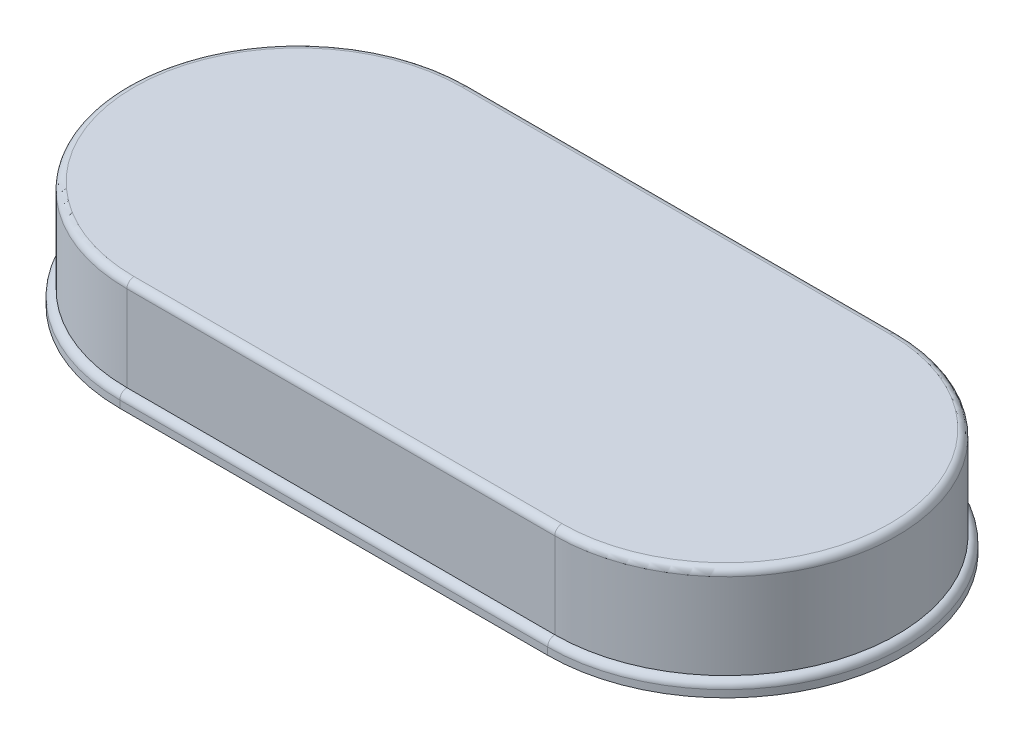
ISO-10303-21;
HEADER;
FILE_DESCRIPTION(('STEP AP214'),'2;1');
FILE_NAME('part.step','',(''),(''),'','','');
FILE_SCHEMA(('AUTOMOTIVE_DESIGN { 1 0 10303 214 1 1 1 1 }'));
ENDSEC;
DATA;
#1=APPLICATION_CONTEXT('core data for automotive mechanical design processes');
#2=APPLICATION_PROTOCOL_DEFINITION('international standard','automotive_design',2000,#1);
#3=PRODUCT_CONTEXT('',#1,'mechanical');
#4=PRODUCT('Part','Part','',(#3));
#5=PRODUCT_RELATED_PRODUCT_CATEGORY('part','',(#4));
#6=PRODUCT_DEFINITION_FORMATION('','',#4);
#7=PRODUCT_DEFINITION_CONTEXT('part definition',#1,'design');
#8=PRODUCT_DEFINITION('design','',#6,#7);
#9=PRODUCT_DEFINITION_SHAPE('','',#8);
#10=(LENGTH_UNIT() NAMED_UNIT(*) SI_UNIT(.MILLI.,.METRE.));
#11=(NAMED_UNIT(*) PLANE_ANGLE_UNIT() SI_UNIT($,.RADIAN.));
#12=(NAMED_UNIT(*) SI_UNIT($,.STERADIAN.) SOLID_ANGLE_UNIT());
#13=UNCERTAINTY_MEASURE_WITH_UNIT(LENGTH_MEASURE(1.E-05),#10,'distance_accuracy_value','');
#14=(GEOMETRIC_REPRESENTATION_CONTEXT(3) GLOBAL_UNCERTAINTY_ASSIGNED_CONTEXT((#13)) GLOBAL_UNIT_ASSIGNED_CONTEXT((#10,
#11,#12)) REPRESENTATION_CONTEXT('',''));
#15=CARTESIAN_POINT('',(0.,0.,0.));
#16=DIRECTION('',(0.,0.,1.));
#17=DIRECTION('',(1.,0.,0.));
#18=AXIS2_PLACEMENT_3D('',#15,#16,#17);
#19=CARTESIAN_POINT('',(8.77463258317007,0.2,-12.3727258149233));
#20=DIRECTION('',(0.,-1.,0.));
#21=DIRECTION('',(0.,0.,-1.));
#22=AXIS2_PLACEMENT_3D('',#19,#20,#21);
#23=CYLINDRICAL_SURFACE('',#22,2.5);
#24=DIRECTION('',(0.,-1.,0.));
#25=VECTOR('',#24,1.);
#26=CARTESIAN_POINT('',(8.77463258317007,0.2,-9.87272581492333));
#27=LINE('',#26,#25);
#28=CARTESIAN_POINT('',(8.77463258317007,0.1,-9.87272581492333));
#29=VERTEX_POINT('',#28);
#30=CARTESIAN_POINT('',(8.77463258317007,0.,-9.87272581492333));
#31=VERTEX_POINT('',#30);
#32=EDGE_CURVE('E131',#29,#31,#27,.T.);
#33=ORIENTED_EDGE('',*,*,#32,.F.);
#34=CARTESIAN_POINT('',(8.77463258317007,0.1,-12.3727258149233));
#35=DIRECTION('',(0.,1.,0.));
#36=DIRECTION('',(0.,0.,1.));
#37=AXIS2_PLACEMENT_3D('',#34,#35,#36);
#38=CIRCLE('',#37,2.5);
#39=CARTESIAN_POINT('',(8.77463258317007,0.1,-14.8727258149233));
#40=VERTEX_POINT('',#39);
#41=EDGE_CURVE('E156',#29,#40,#38,.F.);
#42=ORIENTED_EDGE('',*,*,#41,.T.);
#43=DIRECTION('',(0.,-1.,0.));
#44=VECTOR('',#43,1.);
#45=CARTESIAN_POINT('',(8.77463258317007,0.2,-14.8727258149233));
#46=LINE('',#45,#44);
#47=CARTESIAN_POINT('',(8.77463258317007,0.,-14.8727258149233));
#48=VERTEX_POINT('',#47);
#49=EDGE_CURVE('E216',#40,#48,#46,.T.);
#50=ORIENTED_EDGE('',*,*,#49,.T.);
#51=CARTESIAN_POINT('',(8.77463258317007,0.,-12.3727258149233));
#52=DIRECTION('',(0.,1.,0.));
#53=DIRECTION('',(0.,0.,1.));
#54=AXIS2_PLACEMENT_3D('',#51,#52,#53);
#55=CIRCLE('',#54,2.5);
#56=EDGE_CURVE('E164',#48,#31,#55,.T.);
#57=ORIENTED_EDGE('',*,*,#56,.T.);
#58=EDGE_LOOP('',(#33,#42,#50,#57));
#59=FACE_BOUND('',#58,.T.);
#60=ADVANCED_FACE('F32',(#59),#23,.T.);
#61=CARTESIAN_POINT('',(8.77463258317007,0.2,-9.87272581492333));
#62=DIRECTION('',(0.,0.,-1.));
#63=DIRECTION('',(-1.,0.,0.));
#64=AXIS2_PLACEMENT_3D('',#61,#62,#63);
#65=PLANE('',#64);
#66=DIRECTION('',(0.,-1.,0.));
#67=VECTOR('',#66,1.);
#68=CARTESIAN_POINT('',(14.7746325831701,0.2,-9.87272581492333));
#69=LINE('',#68,#67);
#70=CARTESIAN_POINT('',(14.7746325831701,0.1,-9.87272581492333));
#71=VERTEX_POINT('',#70);
#72=CARTESIAN_POINT('',(14.7746325831701,0.,-9.87272581492333));
#73=VERTEX_POINT('',#72);
#74=EDGE_CURVE('E220',#71,#73,#69,.T.);
#75=ORIENTED_EDGE('',*,*,#74,.F.);
#76=DIRECTION('',(1.,0.,0.));
#77=VECTOR('',#76,1.);
#78=CARTESIAN_POINT('',(8.77463258317007,0.1,-9.87272581492333));
#79=LINE('',#78,#77);
#80=EDGE_CURVE('E154',#71,#29,#79,.F.);
#81=ORIENTED_EDGE('',*,*,#80,.T.);
#82=ORIENTED_EDGE('',*,*,#32,.T.);
#83=DIRECTION('',(1.,0.,0.));
#84=VECTOR('',#83,1.);
#85=CARTESIAN_POINT('',(8.77463258317007,0.,-9.87272581492333));
#86=LINE('',#85,#84);
#87=EDGE_CURVE('E207',#31,#73,#86,.T.);
#88=ORIENTED_EDGE('',*,*,#87,.T.);
#89=EDGE_LOOP('',(#75,#81,#82,#88));
#90=FACE_BOUND('',#89,.T.);
#91=ADVANCED_FACE('F248',(#90),#65,.F.);
#92=CARTESIAN_POINT('',(14.7746325831701,0.2,-12.3727258149233));
#93=DIRECTION('',(0.,-1.,0.));
#94=DIRECTION('',(0.,0.,-1.));
#95=AXIS2_PLACEMENT_3D('',#92,#93,#94);
#96=CYLINDRICAL_SURFACE('',#95,2.5);
#97=DIRECTION('',(0.,-1.,0.));
#98=VECTOR('',#97,1.);
#99=CARTESIAN_POINT('',(14.7746325831701,0.2,-14.8727258149233));
#100=LINE('',#99,#98);
#101=CARTESIAN_POINT('',(14.7746325831701,0.1,-14.8727258149233));
#102=VERTEX_POINT('',#101);
#103=CARTESIAN_POINT('',(14.7746325831701,0.,-14.8727258149233));
#104=VERTEX_POINT('',#103);
#105=EDGE_CURVE('E218',#102,#104,#100,.T.);
#106=ORIENTED_EDGE('',*,*,#105,.F.);
#107=CARTESIAN_POINT('',(14.7746325831701,0.1,-12.3727258149233));
#108=DIRECTION('',(0.,1.,0.));
#109=DIRECTION('',(0.,0.,1.));
#110=AXIS2_PLACEMENT_3D('',#107,#108,#109);
#111=CIRCLE('',#110,2.5);
#112=EDGE_CURVE('E148',#102,#71,#111,.F.);
#113=ORIENTED_EDGE('',*,*,#112,.T.);
#114=ORIENTED_EDGE('',*,*,#74,.T.);
#115=CARTESIAN_POINT('',(14.7746325831701,0.,-12.3727258149233));
#116=DIRECTION('',(0.,1.,0.));
#117=DIRECTION('',(0.,0.,-1.));
#118=AXIS2_PLACEMENT_3D('',#115,#116,#117);
#119=CIRCLE('',#118,2.5);
#120=EDGE_CURVE('E210',#73,#104,#119,.T.);
#121=ORIENTED_EDGE('',*,*,#120,.T.);
#122=EDGE_LOOP('',(#106,#113,#114,#121));
#123=FACE_BOUND('',#122,.T.);
#124=ADVANCED_FACE('F238',(#123),#96,.T.);
#125=CARTESIAN_POINT('',(8.77463258317007,0.2,-14.8727258149233));
#126=DIRECTION('',(0.,0.,1.));
#127=DIRECTION('',(1.,0.,0.));
#128=AXIS2_PLACEMENT_3D('',#125,#126,#127);
#129=PLANE('',#128);
#130=ORIENTED_EDGE('',*,*,#49,.F.);
#131=DIRECTION('',(-1.,0.,0.));
#132=VECTOR('',#131,1.);
#133=CARTESIAN_POINT('',(14.7746325831701,0.1,-14.8727258149233));
#134=LINE('',#133,#132);
#135=EDGE_CURVE('E140',#40,#102,#134,.F.);
#136=ORIENTED_EDGE('',*,*,#135,.T.);
#137=ORIENTED_EDGE('',*,*,#105,.T.);
#138=DIRECTION('',(-1.,0.,0.));
#139=VECTOR('',#138,1.);
#140=CARTESIAN_POINT('',(8.77463258317007,0.,-14.8727258149233));
#141=LINE('',#140,#139);
#142=EDGE_CURVE('E213',#104,#48,#141,.T.);
#143=ORIENTED_EDGE('',*,*,#142,.T.);
#144=EDGE_LOOP('',(#130,#136,#137,#143));
#145=FACE_BOUND('',#144,.T.);
#146=ADVANCED_FACE('F237',(#145),#129,.F.);
#147=CARTESIAN_POINT('',(8.77463258317007,0.,-12.3727258149233));
#148=DIRECTION('',(0.,1.,0.));
#149=DIRECTION('',(0.,0.,1.));
#150=AXIS2_PLACEMENT_3D('',#147,#148,#149);
#151=PLANE('',#150);
#152=ORIENTED_EDGE('',*,*,#56,.F.);
#153=ORIENTED_EDGE('',*,*,#142,.F.);
#154=ORIENTED_EDGE('',*,*,#120,.F.);
#155=ORIENTED_EDGE('',*,*,#87,.F.);
#156=EDGE_LOOP('',(#152,#153,#154,#155));
#157=FACE_BOUND('',#156,.T.);
#158=ADVANCED_FACE('F244',(#157),#151,.F.);
#159=CARTESIAN_POINT('',(8.77463258317007,0.1,-9.97272581492333));
#160=DIRECTION('',(-1.,0.,0.));
#161=DIRECTION('',(0.,0.,1.));
#162=AXIS2_PLACEMENT_3D('',#159,#160,#161);
#163=CYLINDRICAL_SURFACE('',#162,0.1);
#164=CARTESIAN_POINT('',(8.77463258317007,0.1,-9.97272581492333));
#165=DIRECTION('',(-1.,0.,0.));
#166=DIRECTION('',(0.,0.,1.));
#167=AXIS2_PLACEMENT_3D('',#164,#165,#166);
#168=CIRCLE('',#167,0.1);
#169=CARTESIAN_POINT('',(8.77463258317007,0.2,-9.97272581492333));
#170=VERTEX_POINT('',#169);
#171=EDGE_CURVE('E129',#29,#170,#168,.T.);
#172=ORIENTED_EDGE('',*,*,#171,.F.);
#173=ORIENTED_EDGE('',*,*,#80,.F.);
#174=CARTESIAN_POINT('',(14.7746325831701,0.1,-9.97272581492333));
#175=DIRECTION('',(1.,0.,0.));
#176=DIRECTION('',(0.,0.,-1.));
#177=AXIS2_PLACEMENT_3D('',#174,#175,#176);
#178=CIRCLE('',#177,0.1);
#179=CARTESIAN_POINT('',(14.7746325831701,0.2,-9.97272581492333));
#180=VERTEX_POINT('',#179);
#181=EDGE_CURVE('E161',#180,#71,#178,.T.);
#182=ORIENTED_EDGE('',*,*,#181,.F.);
#183=DIRECTION('',(1.,0.,0.));
#184=VECTOR('',#183,1.);
#185=CARTESIAN_POINT('',(14.7746325831701,0.2,-9.97272581492333));
#186=LINE('',#185,#184);
#187=EDGE_CURVE('E130',#170,#180,#186,.T.);
#188=ORIENTED_EDGE('',*,*,#187,.F.);
#189=EDGE_LOOP('',(#172,#173,#182,#188));
#190=FACE_BOUND('',#189,.T.);
#191=ADVANCED_FACE('F227',(#190),#163,.T.);
#192=CARTESIAN_POINT('',(14.7746325831701,0.1,-12.3727258149233));
#193=DIRECTION('',(0.,1.,0.));
#194=DIRECTION('',(0.,0.,1.));
#195=AXIS2_PLACEMENT_3D('',#192,#193,#194);
#196=TOROIDAL_SURFACE('',#195,2.4,0.1);
#197=ORIENTED_EDGE('',*,*,#181,.T.);
#198=ORIENTED_EDGE('',*,*,#112,.F.);
#199=CARTESIAN_POINT('',(14.7746325831701,0.1,-14.7727258149233));
#200=DIRECTION('',(-1.,0.,0.));
#201=DIRECTION('',(0.,0.,1.));
#202=AXIS2_PLACEMENT_3D('',#199,#200,#201);
#203=CIRCLE('',#202,0.1);
#204=CARTESIAN_POINT('',(14.7746325831701,0.2,-14.7727258149233));
#205=VERTEX_POINT('',#204);
#206=EDGE_CURVE('E141',#205,#102,#203,.T.);
#207=ORIENTED_EDGE('',*,*,#206,.F.);
#208=CARTESIAN_POINT('',(14.7746325831701,0.2,-12.3727258149233));
#209=DIRECTION('',(0.,1.,0.));
#210=DIRECTION('',(0.,0.,1.));
#211=AXIS2_PLACEMENT_3D('',#208,#209,#210);
#212=CIRCLE('',#211,2.4);
#213=EDGE_CURVE('E146',#180,#205,#212,.T.);
#214=ORIENTED_EDGE('',*,*,#213,.F.);
#215=EDGE_LOOP('',(#197,#198,#207,#214));
#216=FACE_BOUND('',#215,.T.);
#217=ADVANCED_FACE('F231',(#216),#196,.T.);
#218=CARTESIAN_POINT('',(8.77463258317007,0.1,-12.3727258149233));
#219=DIRECTION('',(0.,1.,0.));
#220=DIRECTION('',(0.,0.,1.));
#221=AXIS2_PLACEMENT_3D('',#218,#219,#220);
#222=TOROIDAL_SURFACE('',#221,2.4,0.1);
#223=ORIENTED_EDGE('',*,*,#171,.T.);
#224=CARTESIAN_POINT('',(8.77463258317007,0.2,-12.3727258149233));
#225=DIRECTION('',(0.,1.,0.));
#226=DIRECTION('',(0.,0.,1.));
#227=AXIS2_PLACEMENT_3D('',#224,#225,#226);
#228=CIRCLE('',#227,2.4);
#229=CARTESIAN_POINT('',(8.77463258317007,0.2,-14.7727258149233));
#230=VERTEX_POINT('',#229);
#231=EDGE_CURVE('E113',#230,#170,#228,.T.);
#232=ORIENTED_EDGE('',*,*,#231,.F.);
#233=CARTESIAN_POINT('',(8.77463258317007,0.1,-14.7727258149233));
#234=DIRECTION('',(1.,0.,0.));
#235=DIRECTION('',(0.,0.,-1.));
#236=AXIS2_PLACEMENT_3D('',#233,#234,#235);
#237=CIRCLE('',#236,0.1);
#238=EDGE_CURVE('E127',#40,#230,#237,.T.);
#239=ORIENTED_EDGE('',*,*,#238,.F.);
#240=ORIENTED_EDGE('',*,*,#41,.F.);
#241=EDGE_LOOP('',(#223,#232,#239,#240));
#242=FACE_BOUND('',#241,.T.);
#243=ADVANCED_FACE('F125',(#242),#222,.T.);
#244=CARTESIAN_POINT('',(8.77463258317007,0.1,-14.7727258149233));
#245=DIRECTION('',(1.,0.,0.));
#246=DIRECTION('',(0.,0.,-1.));
#247=AXIS2_PLACEMENT_3D('',#244,#245,#246);
#248=CYLINDRICAL_SURFACE('',#247,0.1);
#249=ORIENTED_EDGE('',*,*,#206,.T.);
#250=ORIENTED_EDGE('',*,*,#135,.F.);
#251=ORIENTED_EDGE('',*,*,#238,.T.);
#252=DIRECTION('',(-1.,0.,0.));
#253=VECTOR('',#252,1.);
#254=CARTESIAN_POINT('',(8.77463258317007,0.2,-14.7727258149233));
#255=LINE('',#254,#253);
#256=EDGE_CURVE('E137',#205,#230,#255,.T.);
#257=ORIENTED_EDGE('',*,*,#256,.F.);
#258=EDGE_LOOP('',(#249,#250,#251,#257));
#259=FACE_BOUND('',#258,.T.);
#260=ADVANCED_FACE('F136',(#259),#248,.T.);
#261=CARTESIAN_POINT('',(8.77463258317007,1.5,-12.3727258149233));
#262=DIRECTION('',(0.,-1.,0.));
#263=DIRECTION('',(0.,0.,-1.));
#264=AXIS2_PLACEMENT_3D('',#261,#262,#263);
#265=CYLINDRICAL_SURFACE('',#264,2.4);
#266=DIRECTION('',(0.,-1.,0.));
#267=VECTOR('',#266,1.);
#268=CARTESIAN_POINT('',(8.77463258317007,1.5,-9.97272581492333));
#269=LINE('',#268,#267);
#270=CARTESIAN_POINT('',(8.77463258317007,1.4,-9.97272581492333));
#271=VERTEX_POINT('',#270);
#272=EDGE_CURVE('E142',#271,#170,#269,.T.);
#273=ORIENTED_EDGE('',*,*,#272,.F.);
#274=CARTESIAN_POINT('',(8.77463258317007,1.4,-12.3727258149233));
#275=DIRECTION('',(0.,-1.,0.));
#276=DIRECTION('',(0.,0.,-1.));
#277=AXIS2_PLACEMENT_3D('',#274,#275,#276);
#278=CIRCLE('',#277,2.4);
#279=CARTESIAN_POINT('',(8.77463258317007,1.4,-14.7727258149233));
#280=VERTEX_POINT('',#279);
#281=EDGE_CURVE('E11',#271,#280,#278,.T.);
#282=ORIENTED_EDGE('',*,*,#281,.T.);
#283=DIRECTION('',(0.,-1.,0.));
#284=VECTOR('',#283,1.);
#285=CARTESIAN_POINT('',(8.77463258317007,1.5,-14.7727258149233));
#286=LINE('',#285,#284);
#287=EDGE_CURVE('E110',#280,#230,#286,.T.);
#288=ORIENTED_EDGE('',*,*,#287,.T.);
#289=ORIENTED_EDGE('',*,*,#231,.T.);
#290=EDGE_LOOP('',(#273,#282,#288,#289));
#291=FACE_BOUND('',#290,.T.);
#292=ADVANCED_FACE('F112',(#291),#265,.T.);
#293=CARTESIAN_POINT('',(8.77463258317007,1.5,-9.97272581492333));
#294=DIRECTION('',(0.,0.,-1.));
#295=DIRECTION('',(-1.,0.,0.));
#296=AXIS2_PLACEMENT_3D('',#293,#294,#295);
#297=PLANE('',#296);
#298=DIRECTION('',(0.,-1.,0.));
#299=VECTOR('',#298,1.);
#300=CARTESIAN_POINT('',(14.7746325831701,1.5,-9.97272581492333));
#301=LINE('',#300,#299);
#302=CARTESIAN_POINT('',(14.7746325831701,1.4,-9.97272581492333));
#303=VERTEX_POINT('',#302);
#304=EDGE_CURVE('E200',#303,#180,#301,.T.);
#305=ORIENTED_EDGE('',*,*,#304,.F.);
#306=DIRECTION('',(1.,0.,0.));
#307=VECTOR('',#306,1.);
#308=CARTESIAN_POINT('',(8.77463258317007,1.4,-9.97272581492333));
#309=LINE('',#308,#307);
#310=EDGE_CURVE('E41',#303,#271,#309,.F.);
#311=ORIENTED_EDGE('',*,*,#310,.T.);
#312=ORIENTED_EDGE('',*,*,#272,.T.);
#313=ORIENTED_EDGE('',*,*,#187,.T.);
#314=EDGE_LOOP('',(#305,#311,#312,#313));
#315=FACE_BOUND('',#314,.T.);
#316=ADVANCED_FACE('F224',(#315),#297,.F.);
#317=CARTESIAN_POINT('',(14.7746325831701,1.5,-12.3727258149233));
#318=DIRECTION('',(0.,-1.,0.));
#319=DIRECTION('',(0.,0.,-1.));
#320=AXIS2_PLACEMENT_3D('',#317,#318,#319);
#321=CYLINDRICAL_SURFACE('',#320,2.4);
#322=DIRECTION('',(0.,-1.,0.));
#323=VECTOR('',#322,1.);
#324=CARTESIAN_POINT('',(14.7746325831701,1.5,-14.7727258149233));
#325=LINE('',#324,#323);
#326=CARTESIAN_POINT('',(14.7746325831701,1.4,-14.7727258149233));
#327=VERTEX_POINT('',#326);
#328=EDGE_CURVE('E119',#327,#205,#325,.T.);
#329=ORIENTED_EDGE('',*,*,#328,.F.);
#330=CARTESIAN_POINT('',(14.7746325831701,1.4,-12.3727258149233));
#331=DIRECTION('',(0.,-1.,0.));
#332=DIRECTION('',(0.,0.,-1.));
#333=AXIS2_PLACEMENT_3D('',#330,#331,#332);
#334=CIRCLE('',#333,2.4);
#335=EDGE_CURVE('E56',#327,#303,#334,.T.);
#336=ORIENTED_EDGE('',*,*,#335,.T.);
#337=ORIENTED_EDGE('',*,*,#304,.T.);
#338=ORIENTED_EDGE('',*,*,#213,.T.);
#339=EDGE_LOOP('',(#329,#336,#337,#338));
#340=FACE_BOUND('',#339,.T.);
#341=ADVANCED_FACE('F198',(#340),#321,.T.);
#342=CARTESIAN_POINT('',(8.77463258317007,1.5,-14.7727258149233));
#343=DIRECTION('',(0.,0.,1.));
#344=DIRECTION('',(1.,0.,0.));
#345=AXIS2_PLACEMENT_3D('',#342,#343,#344);
#346=PLANE('',#345);
#347=ORIENTED_EDGE('',*,*,#287,.F.);
#348=DIRECTION('',(-1.,0.,0.));
#349=VECTOR('',#348,1.);
#350=CARTESIAN_POINT('',(8.77463258317007,1.4,-14.7727258149233));
#351=LINE('',#350,#349);
#352=EDGE_CURVE('E173',#280,#327,#351,.F.);
#353=ORIENTED_EDGE('',*,*,#352,.T.);
#354=ORIENTED_EDGE('',*,*,#328,.T.);
#355=ORIENTED_EDGE('',*,*,#256,.T.);
#356=EDGE_LOOP('',(#347,#353,#354,#355));
#357=FACE_BOUND('',#356,.T.);
#358=ADVANCED_FACE('F144',(#357),#346,.F.);
#359=CARTESIAN_POINT('',(8.77463258317007,1.5,-12.3727258149233));
#360=DIRECTION('',(0.,-1.,0.));
#361=DIRECTION('',(0.,0.,-1.));
#362=AXIS2_PLACEMENT_3D('',#359,#360,#361);
#363=PLANE('',#362);
#364=CARTESIAN_POINT('',(14.7746325831701,1.5,-12.3727258149233));
#365=DIRECTION('',(0.,-1.,0.));
#366=DIRECTION('',(0.,0.,-1.));
#367=AXIS2_PLACEMENT_3D('',#364,#365,#366);
#368=CIRCLE('',#367,2.3);
#369=CARTESIAN_POINT('',(14.7746325831701,1.5,-10.0727258149233));
#370=VERTEX_POINT('',#369);
#371=CARTESIAN_POINT('',(14.7746325831701,1.5,-14.6727258149233));
#372=VERTEX_POINT('',#371);
#373=EDGE_CURVE('E168',#370,#372,#368,.F.);
#374=ORIENTED_EDGE('',*,*,#373,.T.);
#375=DIRECTION('',(-1.,0.,0.));
#376=VECTOR('',#375,1.);
#377=CARTESIAN_POINT('',(8.77463258317007,1.5,-14.6727258149233));
#378=LINE('',#377,#376);
#379=CARTESIAN_POINT('',(8.77463258317007,1.5,-14.6727258149233));
#380=VERTEX_POINT('',#379);
#381=EDGE_CURVE('E170',#372,#380,#378,.T.);
#382=ORIENTED_EDGE('',*,*,#381,.T.);
#383=CARTESIAN_POINT('',(8.77463258317007,1.5,-12.3727258149233));
#384=DIRECTION('',(0.,-1.,0.));
#385=DIRECTION('',(0.,0.,-1.));
#386=AXIS2_PLACEMENT_3D('',#383,#384,#385);
#387=CIRCLE('',#386,2.3);
#388=CARTESIAN_POINT('',(8.77463258317007,1.5,-10.0727258149233));
#389=VERTEX_POINT('',#388);
#390=EDGE_CURVE('E157',#380,#389,#387,.F.);
#391=ORIENTED_EDGE('',*,*,#390,.T.);
#392=DIRECTION('',(1.,0.,0.));
#393=VECTOR('',#392,1.);
#394=CARTESIAN_POINT('',(8.77463258317007,1.5,-10.0727258149233));
#395=LINE('',#394,#393);
#396=EDGE_CURVE('E166',#389,#370,#395,.T.);
#397=ORIENTED_EDGE('',*,*,#396,.T.);
#398=EDGE_LOOP('',(#374,#382,#391,#397));
#399=FACE_BOUND('',#398,.T.);
#400=ADVANCED_FACE('F274',(#399),#363,.F.);
#401=CARTESIAN_POINT('',(8.77463258317007,1.4,-10.0727258149233));
#402=DIRECTION('',(1.,0.,0.));
#403=DIRECTION('',(0.,0.,-1.));
#404=AXIS2_PLACEMENT_3D('',#401,#402,#403);
#405=CYLINDRICAL_SURFACE('',#404,0.1);
#406=CARTESIAN_POINT('',(8.77463258317007,1.4,-10.0727258149233));
#407=DIRECTION('',(-1.,0.,0.));
#408=DIRECTION('',(0.,0.,1.));
#409=AXIS2_PLACEMENT_3D('',#406,#407,#408);
#410=CIRCLE('',#409,0.1);
#411=EDGE_CURVE('E180',#271,#389,#410,.T.);
#412=ORIENTED_EDGE('',*,*,#411,.F.);
#413=ORIENTED_EDGE('',*,*,#310,.F.);
#414=CARTESIAN_POINT('',(14.7746325831701,1.4,-10.0727258149233));
#415=DIRECTION('',(1.,0.,0.));
#416=DIRECTION('',(0.,0.,-1.));
#417=AXIS2_PLACEMENT_3D('',#414,#415,#416);
#418=CIRCLE('',#417,0.1);
#419=EDGE_CURVE('E36',#370,#303,#418,.T.);
#420=ORIENTED_EDGE('',*,*,#419,.F.);
#421=ORIENTED_EDGE('',*,*,#396,.F.);
#422=EDGE_LOOP('',(#412,#413,#420,#421));
#423=FACE_BOUND('',#422,.T.);
#424=ADVANCED_FACE('F34',(#423),#405,.T.);
#425=CARTESIAN_POINT('',(14.7746325831701,1.4,-12.3727258149233));
#426=DIRECTION('',(0.,-1.,0.));
#427=DIRECTION('',(0.,0.,-1.));
#428=AXIS2_PLACEMENT_3D('',#425,#426,#427);
#429=TOROIDAL_SURFACE('',#428,2.3,0.1);
#430=ORIENTED_EDGE('',*,*,#419,.T.);
#431=ORIENTED_EDGE('',*,*,#335,.F.);
#432=CARTESIAN_POINT('',(14.7746325831701,1.4,-14.6727258149233));
#433=DIRECTION('',(-1.,0.,0.));
#434=DIRECTION('',(0.,0.,1.));
#435=AXIS2_PLACEMENT_3D('',#432,#433,#434);
#436=CIRCLE('',#435,0.1);
#437=EDGE_CURVE('E179',#372,#327,#436,.T.);
#438=ORIENTED_EDGE('',*,*,#437,.F.);
#439=ORIENTED_EDGE('',*,*,#373,.F.);
#440=EDGE_LOOP('',(#430,#431,#438,#439));
#441=FACE_BOUND('',#440,.T.);
#442=ADVANCED_FACE('F189',(#441),#429,.T.);
#443=CARTESIAN_POINT('',(8.77463258317007,1.4,-12.3727258149233));
#444=DIRECTION('',(0.,-1.,0.));
#445=DIRECTION('',(0.,0.,-1.));
#446=AXIS2_PLACEMENT_3D('',#443,#444,#445);
#447=TOROIDAL_SURFACE('',#446,2.3,0.1);
#448=ORIENTED_EDGE('',*,*,#411,.T.);
#449=ORIENTED_EDGE('',*,*,#390,.F.);
#450=CARTESIAN_POINT('',(8.77463258317007,1.4,-14.6727258149233));
#451=DIRECTION('',(1.,0.,0.));
#452=DIRECTION('',(0.,0.,-1.));
#453=AXIS2_PLACEMENT_3D('',#450,#451,#452);
#454=CIRCLE('',#453,0.1);
#455=EDGE_CURVE('E177',#280,#380,#454,.T.);
#456=ORIENTED_EDGE('',*,*,#455,.F.);
#457=ORIENTED_EDGE('',*,*,#281,.F.);
#458=EDGE_LOOP('',(#448,#449,#456,#457));
#459=FACE_BOUND('',#458,.T.);
#460=ADVANCED_FACE('F194',(#459),#447,.T.);
#461=CARTESIAN_POINT('',(8.77463258317007,1.4,-14.6727258149233));
#462=DIRECTION('',(-1.,0.,0.));
#463=DIRECTION('',(0.,0.,1.));
#464=AXIS2_PLACEMENT_3D('',#461,#462,#463);
#465=CYLINDRICAL_SURFACE('',#464,0.1);
#466=ORIENTED_EDGE('',*,*,#437,.T.);
#467=ORIENTED_EDGE('',*,*,#352,.F.);
#468=ORIENTED_EDGE('',*,*,#455,.T.);
#469=ORIENTED_EDGE('',*,*,#381,.F.);
#470=EDGE_LOOP('',(#466,#467,#468,#469));
#471=FACE_BOUND('',#470,.T.);
#472=ADVANCED_FACE('F197',(#471),#465,.T.);
#473=CLOSED_SHELL('',(#60,#91,#124,#146,#158,#191,#217,#243,#260,#292,#316,#341,#358,#400,#424,
#442,#460,#472));
#474=MANIFOLD_SOLID_BREP('B2',#473);
#475=ADVANCED_BREP_SHAPE_REPRESENTATION('',(#18,#474),#14);
#476=SHAPE_DEFINITION_REPRESENTATION(#9,#475);
ENDSEC;
END-ISO-10303-21;
